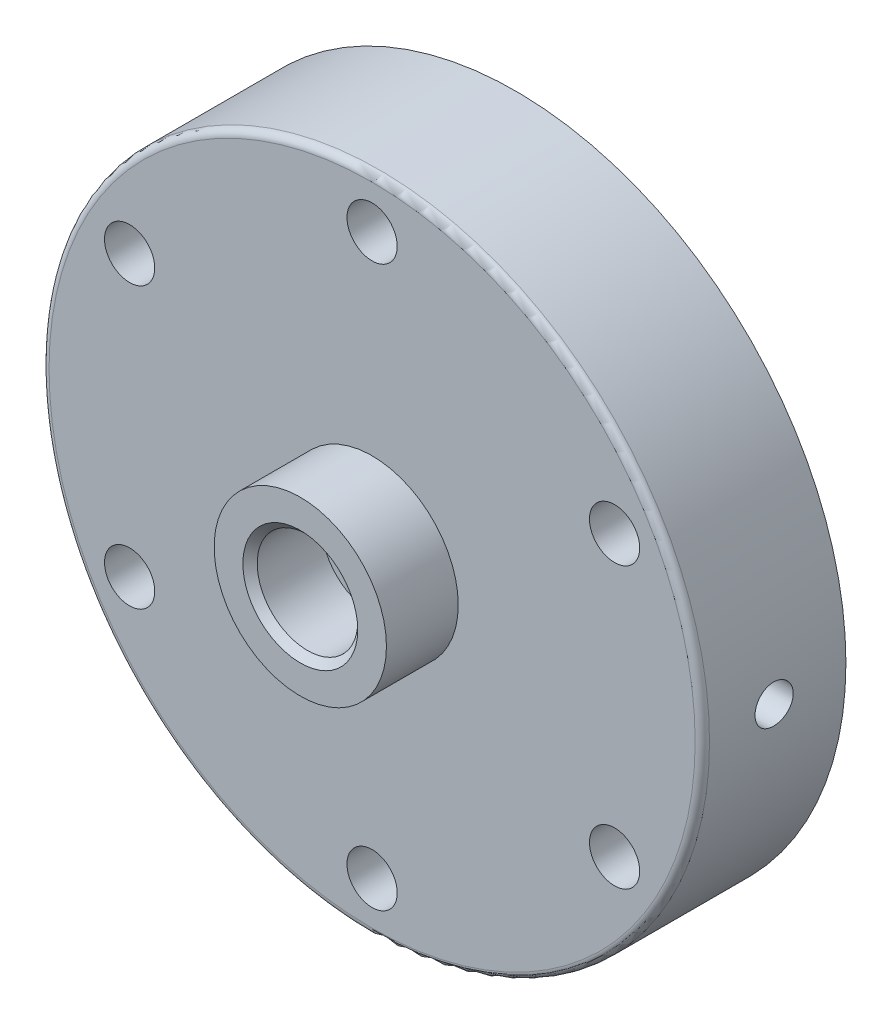
ISO-10303-21;
HEADER;
FILE_DESCRIPTION(('STEP AP214'),'2;1');
FILE_NAME('part.step','',(''),(''),'','','');
FILE_SCHEMA(('AUTOMOTIVE_DESIGN { 1 0 10303 214 1 1 1 1 }'));
ENDSEC;
DATA;
#1=APPLICATION_CONTEXT('core data for automotive mechanical design processes');
#2=APPLICATION_PROTOCOL_DEFINITION('international standard','automotive_design',2000,#1);
#3=PRODUCT_CONTEXT('',#1,'mechanical');
#4=PRODUCT('Part','Part','',(#3));
#5=PRODUCT_RELATED_PRODUCT_CATEGORY('part','',(#4));
#6=PRODUCT_DEFINITION_FORMATION('','',#4);
#7=PRODUCT_DEFINITION_CONTEXT('part definition',#1,'design');
#8=PRODUCT_DEFINITION('design','',#6,#7);
#9=PRODUCT_DEFINITION_SHAPE('','',#8);
#10=(LENGTH_UNIT() NAMED_UNIT(*) SI_UNIT(.MILLI.,.METRE.));
#11=(NAMED_UNIT(*) PLANE_ANGLE_UNIT() SI_UNIT($,.RADIAN.));
#12=(NAMED_UNIT(*) SI_UNIT($,.STERADIAN.) SOLID_ANGLE_UNIT());
#13=UNCERTAINTY_MEASURE_WITH_UNIT(LENGTH_MEASURE(1.E-05),#10,'distance_accuracy_value','');
#14=(GEOMETRIC_REPRESENTATION_CONTEXT(3) GLOBAL_UNCERTAINTY_ASSIGNED_CONTEXT((#13)) GLOBAL_UNIT_ASSIGNED_CONTEXT((#10,
#11,#12)) REPRESENTATION_CONTEXT('',''));
#15=CARTESIAN_POINT('',(0.,0.,0.));
#16=DIRECTION('',(0.,0.,1.));
#17=DIRECTION('',(1.,0.,0.));
#18=AXIS2_PLACEMENT_3D('',#15,#16,#17);
#19=CARTESIAN_POINT('',(0.,0.,20.));
#20=DIRECTION('',(0.,0.,-1.));
#21=DIRECTION('',(-1.,0.,0.));
#22=AXIS2_PLACEMENT_3D('',#19,#20,#21);
#23=CYLINDRICAL_SURFACE('',#22,2.5);
#24=CARTESIAN_POINT('',(0.,0.,20.));
#25=DIRECTION('',(0.,0.,1.));
#26=DIRECTION('',(1.,0.,0.));
#27=AXIS2_PLACEMENT_3D('',#24,#25,#26);
#28=CIRCLE('',#27,2.5);
#29=CARTESIAN_POINT('',(2.5,0.,20.));
#30=VERTEX_POINT('',#29);
#31=EDGE_CURVE('E208',#30,#30,#28,.T.);
#32=ORIENTED_EDGE('',*,*,#31,.T.);
#33=EDGE_LOOP('',(#32));
#34=FACE_BOUND('',#33,.T.);
#35=CARTESIAN_POINT('',(0.,0.,14.));
#36=DIRECTION('',(0.,0.,-1.));
#37=DIRECTION('',(-1.,0.,0.));
#38=AXIS2_PLACEMENT_3D('',#35,#36,#37);
#39=CIRCLE('',#38,2.5);
#40=CARTESIAN_POINT('',(-2.5,0.,14.));
#41=VERTEX_POINT('',#40);
#42=EDGE_CURVE('E234',#41,#41,#39,.T.);
#43=ORIENTED_EDGE('',*,*,#42,.T.);
#44=EDGE_LOOP('',(#43));
#45=FACE_BOUND('',#44,.T.);
#46=ADVANCED_FACE('F43',(#34,#45),#23,.F.);
#47=CARTESIAN_POINT('',(0.,0.,20.));
#48=DIRECTION('',(0.,0.,1.));
#49=DIRECTION('',(1.,0.,0.));
#50=AXIS2_PLACEMENT_3D('',#47,#48,#49);
#51=PLANE('',#50);
#52=ORIENTED_EDGE('',*,*,#31,.F.);
#53=EDGE_LOOP('',(#52));
#54=FACE_BOUND('',#53,.T.);
#55=CARTESIAN_POINT('',(0.,0.,20.));
#56=DIRECTION('',(0.,0.,1.));
#57=DIRECTION('',(1.,0.,0.));
#58=AXIS2_PLACEMENT_3D('',#55,#56,#57);
#59=CIRCLE('',#58,7.);
#60=CARTESIAN_POINT('',(7.,0.,20.));
#61=VERTEX_POINT('',#60);
#62=EDGE_CURVE('E224',#61,#61,#59,.F.);
#63=ORIENTED_EDGE('',*,*,#62,.F.);
#64=EDGE_LOOP('',(#63));
#65=FACE_BOUND('',#64,.T.);
#66=ADVANCED_FACE('F125',(#54,#65),#51,.T.);
#67=CARTESIAN_POINT('',(0.,0.,20.));
#68=DIRECTION('',(0.,0.,1.));
#69=DIRECTION('',(1.,0.,0.));
#70=AXIS2_PLACEMENT_3D('',#67,#68,#69);
#71=CIRCLE('',#70,45.);
#72=CARTESIAN_POINT('',(45.,0.,20.));
#73=VERTEX_POINT('',#72);
#74=EDGE_CURVE('E57',#73,#73,#71,.T.);
#75=ORIENTED_EDGE('',*,*,#74,.T.);
#76=EDGE_LOOP('',(#75));
#77=FACE_BOUND('',#76,.T.);
#78=CARTESIAN_POINT('',(0.,0.,20.));
#79=DIRECTION('',(0.,0.,1.));
#80=DIRECTION('',(1.,0.,0.));
#81=AXIS2_PLACEMENT_3D('',#78,#79,#80);
#82=CIRCLE('',#81,12.);
#83=CARTESIAN_POINT('',(12.,0.,20.));
#84=VERTEX_POINT('',#83);
#85=EDGE_CURVE('E152',#84,#84,#82,.T.);
#86=ORIENTED_EDGE('',*,*,#85,.F.);
#87=EDGE_LOOP('',(#86));
#88=FACE_BOUND('',#87,.T.);
#89=CARTESIAN_POINT('',(-33.7749907475898,-19.5000000000019,20.));
#90=DIRECTION('',(0.,0.,1.));
#91=DIRECTION('',(1.,0.,0.));
#92=AXIS2_PLACEMENT_3D('',#89,#90,#91);
#93=CIRCLE('',#92,3.50000000000408);
#94=CARTESIAN_POINT('',(-30.2749907475857,-19.5000000000019,20.));
#95=VERTEX_POINT('',#94);
#96=EDGE_CURVE('E156',#95,#95,#93,.T.);
#97=ORIENTED_EDGE('',*,*,#96,.F.);
#98=EDGE_LOOP('',(#97));
#99=FACE_BOUND('',#98,.T.);
#100=CARTESIAN_POINT('',(33.7749907475964,-19.4999999999981,20.));
#101=DIRECTION('',(0.,0.,1.));
#102=DIRECTION('',(1.,0.,0.));
#103=AXIS2_PLACEMENT_3D('',#100,#101,#102);
#104=CIRCLE('',#103,3.50000000000279);
#105=CARTESIAN_POINT('',(37.2749907475992,-19.4999999999981,20.));
#106=VERTEX_POINT('',#105);
#107=EDGE_CURVE('E160',#106,#106,#104,.T.);
#108=ORIENTED_EDGE('',*,*,#107,.F.);
#109=EDGE_LOOP('',(#108));
#110=FACE_BOUND('',#109,.T.);
#111=CARTESIAN_POINT('',(0.,39.,20.));
#112=DIRECTION('',(0.,0.,1.));
#113=DIRECTION('',(1.,0.,0.));
#114=AXIS2_PLACEMENT_3D('',#111,#112,#113);
#115=CIRCLE('',#114,3.5);
#116=CARTESIAN_POINT('',(3.5,39.,20.));
#117=VERTEX_POINT('',#116);
#118=EDGE_CURVE('E164',#117,#117,#115,.T.);
#119=ORIENTED_EDGE('',*,*,#118,.F.);
#120=EDGE_LOOP('',(#119));
#121=FACE_BOUND('',#120,.T.);
#122=CARTESIAN_POINT('',(33.7749907475942,19.5000000000019,20.));
#123=DIRECTION('',(0.,0.,1.));
#124=DIRECTION('',(1.,0.,0.));
#125=AXIS2_PLACEMENT_3D('',#122,#123,#124);
#126=CIRCLE('',#125,3.5000000000006);
#127=CARTESIAN_POINT('',(37.2749907475948,19.5000000000019,20.));
#128=VERTEX_POINT('',#127);
#129=EDGE_CURVE('E168',#128,#128,#126,.T.);
#130=ORIENTED_EDGE('',*,*,#129,.F.);
#131=EDGE_LOOP('',(#130));
#132=FACE_BOUND('',#131,.T.);
#133=CARTESIAN_POINT('',(4.419458303593E-12,-39.,20.));
#134=DIRECTION('',(0.,0.,1.));
#135=DIRECTION('',(1.,0.,0.));
#136=AXIS2_PLACEMENT_3D('',#133,#134,#135);
#137=CIRCLE('',#136,3.50000000000449);
#138=CARTESIAN_POINT('',(3.50000000000891,-39.,20.));
#139=VERTEX_POINT('',#138);
#140=EDGE_CURVE('E172',#139,#139,#137,.T.);
#141=ORIENTED_EDGE('',*,*,#140,.F.);
#142=EDGE_LOOP('',(#141));
#143=FACE_BOUND('',#142,.T.);
#144=CARTESIAN_POINT('',(-33.774990747592,19.4999999999981,20.));
#145=DIRECTION('',(0.,0.,1.));
#146=DIRECTION('',(1.,0.,0.));
#147=AXIS2_PLACEMENT_3D('',#144,#145,#146);
#148=CIRCLE('',#147,3.50000000000208);
#149=CARTESIAN_POINT('',(-30.2749907475899,19.4999999999981,20.));
#150=VERTEX_POINT('',#149);
#151=EDGE_CURVE('E175',#150,#150,#148,.T.);
#152=ORIENTED_EDGE('',*,*,#151,.F.);
#153=EDGE_LOOP('',(#152));
#154=FACE_BOUND('',#153,.T.);
#155=ADVANCED_FACE('F131',(#77,#88,#99,#110,#121,#132,#143,#154),#51,.T.);
#156=CARTESIAN_POINT('',(0.,0.,0.));
#157=DIRECTION('',(0.,0.,1.));
#158=DIRECTION('',(1.,0.,0.));
#159=AXIS2_PLACEMENT_3D('',#156,#157,#158);
#160=PLANE('',#159);
#161=CARTESIAN_POINT('',(0.,0.,0.));
#162=DIRECTION('',(0.,0.,-1.));
#163=DIRECTION('',(-1.,0.,0.));
#164=AXIS2_PLACEMENT_3D('',#161,#162,#163);
#165=CIRCLE('',#164,33.);
#166=CARTESIAN_POINT('',(-33.,0.,0.));
#167=VERTEX_POINT('',#166);
#168=EDGE_CURVE('E242',#167,#167,#165,.T.);
#169=ORIENTED_EDGE('',*,*,#168,.F.);
#170=EDGE_LOOP('',(#169));
#171=FACE_BOUND('',#170,.T.);
#172=CARTESIAN_POINT('',(0.,0.,0.));
#173=DIRECTION('',(0.,0.,1.));
#174=DIRECTION('',(1.,0.,0.));
#175=AXIS2_PLACEMENT_3D('',#172,#173,#174);
#176=CIRCLE('',#175,46.);
#177=CARTESIAN_POINT('',(46.,0.,0.));
#178=VERTEX_POINT('',#177);
#179=EDGE_CURVE('E217',#178,#178,#176,.T.);
#180=ORIENTED_EDGE('',*,*,#179,.F.);
#181=EDGE_LOOP('',(#180));
#182=FACE_BOUND('',#181,.T.);
#183=CARTESIAN_POINT('',(0.,39.,0.));
#184=DIRECTION('',(0.,0.,1.));
#185=DIRECTION('',(1.,0.,0.));
#186=AXIS2_PLACEMENT_3D('',#183,#184,#185);
#187=CIRCLE('',#186,3.5);
#188=CARTESIAN_POINT('',(3.5,39.,0.));
#189=VERTEX_POINT('',#188);
#190=EDGE_CURVE('E214',#189,#189,#187,.T.);
#191=ORIENTED_EDGE('',*,*,#190,.T.);
#192=EDGE_LOOP('',(#191));
#193=FACE_BOUND('',#192,.T.);
#194=CARTESIAN_POINT('',(33.7749907475942,19.5000000000019,0.));
#195=DIRECTION('',(0.,0.,1.));
#196=DIRECTION('',(1.,0.,0.));
#197=AXIS2_PLACEMENT_3D('',#194,#195,#196);
#198=CIRCLE('',#197,3.5000000000006);
#199=CARTESIAN_POINT('',(37.2749907475948,19.5000000000019,0.));
#200=VERTEX_POINT('',#199);
#201=EDGE_CURVE('E202',#200,#200,#198,.T.);
#202=ORIENTED_EDGE('',*,*,#201,.T.);
#203=EDGE_LOOP('',(#202));
#204=FACE_BOUND('',#203,.T.);
#205=CARTESIAN_POINT('',(33.7749907475964,-19.4999999999981,0.));
#206=DIRECTION('',(0.,0.,1.));
#207=DIRECTION('',(1.,0.,0.));
#208=AXIS2_PLACEMENT_3D('',#205,#206,#207);
#209=CIRCLE('',#208,3.50000000000279);
#210=CARTESIAN_POINT('',(37.2749907475992,-19.4999999999981,0.));
#211=VERTEX_POINT('',#210);
#212=EDGE_CURVE('E196',#211,#211,#209,.T.);
#213=ORIENTED_EDGE('',*,*,#212,.T.);
#214=EDGE_LOOP('',(#213));
#215=FACE_BOUND('',#214,.T.);
#216=CARTESIAN_POINT('',(4.419458303593E-12,-39.,0.));
#217=DIRECTION('',(0.,0.,1.));
#218=DIRECTION('',(1.,0.,0.));
#219=AXIS2_PLACEMENT_3D('',#216,#217,#218);
#220=CIRCLE('',#219,3.50000000000449);
#221=CARTESIAN_POINT('',(3.50000000000891,-39.,0.));
#222=VERTEX_POINT('',#221);
#223=EDGE_CURVE('E192',#222,#222,#220,.T.);
#224=ORIENTED_EDGE('',*,*,#223,.T.);
#225=EDGE_LOOP('',(#224));
#226=FACE_BOUND('',#225,.T.);
#227=CARTESIAN_POINT('',(-33.7749907475898,-19.5000000000019,0.));
#228=DIRECTION('',(0.,0.,1.));
#229=DIRECTION('',(1.,0.,0.));
#230=AXIS2_PLACEMENT_3D('',#227,#228,#229);
#231=CIRCLE('',#230,3.50000000000408);
#232=CARTESIAN_POINT('',(-30.2749907475857,-19.5000000000019,0.));
#233=VERTEX_POINT('',#232);
#234=EDGE_CURVE('E178',#233,#233,#231,.T.);
#235=ORIENTED_EDGE('',*,*,#234,.T.);
#236=EDGE_LOOP('',(#235));
#237=FACE_BOUND('',#236,.T.);
#238=CARTESIAN_POINT('',(-33.774990747592,19.4999999999981,0.));
#239=DIRECTION('',(0.,0.,1.));
#240=DIRECTION('',(1.,0.,0.));
#241=AXIS2_PLACEMENT_3D('',#238,#239,#240);
#242=CIRCLE('',#241,3.50000000000208);
#243=CARTESIAN_POINT('',(-30.2749907475899,19.4999999999981,0.));
#244=VERTEX_POINT('',#243);
#245=EDGE_CURVE('E179',#244,#244,#242,.T.);
#246=ORIENTED_EDGE('',*,*,#245,.T.);
#247=EDGE_LOOP('',(#246));
#248=FACE_BOUND('',#247,.T.);
#249=ADVANCED_FACE('F104',(#171,#182,#193,#204,#215,#226,#237,#248),#160,.F.);
#250=CARTESIAN_POINT('',(0.,0.,20.));
#251=DIRECTION('',(0.,0.,-1.));
#252=DIRECTION('',(-1.,0.,0.));
#253=AXIS2_PLACEMENT_3D('',#250,#251,#252);
#254=CYLINDRICAL_SURFACE('',#253,46.);
#255=CARTESIAN_POINT('',(-46.,0.,7.33976097996437));
#256=CARTESIAN_POINT('',(-45.999998974776,0.149292917161702,7.33976755696187));
#257=CARTESIAN_POINT('',(-45.9992654279732,0.298690903799143,7.35237070533642));
#258=CARTESIAN_POINT('',(-45.9964096857222,0.593363200255416,7.40246712973012));
#259=CARTESIAN_POINT('',(-45.9942858661076,0.73863247940457,7.43998951804291));
#260=CARTESIAN_POINT('',(-45.9888898870718,1.02073626022256,7.53884445911305));
#261=CARTESIAN_POINT('',(-45.9856183253,1.15757510825203,7.60016462171377));
#262=CARTESIAN_POINT('',(-45.9782950198087,1.41898116754632,7.74485478413762));
#263=CARTESIAN_POINT('',(-45.9742434570167,1.54355121455091,7.82821967217774));
#264=CARTESIAN_POINT('',(-45.9658098046685,1.77708220584144,8.01475250873708));
#265=CARTESIAN_POINT('',(-45.9614273416313,1.88602509759197,8.1179430431944));
#266=CARTESIAN_POINT('',(-45.9528290183082,2.08505508646386,8.34115188228659));
#267=CARTESIAN_POINT('',(-45.9486131649268,2.17514140280068,8.46117088338567));
#268=CARTESIAN_POINT('',(-45.9408206759462,2.33395478604573,8.71472958853048));
#269=CARTESIAN_POINT('',(-45.937244481294,2.40266714280453,8.84827852081625));
#270=CARTESIAN_POINT('',(-45.9311393395253,2.51668791417905,9.12504133712409));
#271=CARTESIAN_POINT('',(-45.9286103824732,2.56199655083487,9.26825512943734));
#272=CARTESIAN_POINT('',(-45.9248884051809,2.6278743956767,9.56011089953697));
#273=CARTESIAN_POINT('',(-45.9236938794532,2.64847148504125,9.70874656446108));
#274=CARTESIAN_POINT('',(-45.9227709584627,2.66442761199094,10.0073700798411));
#275=CARTESIAN_POINT('',(-45.9230425486075,2.65978690076881,10.157357916824));
#276=CARTESIAN_POINT('',(-45.9250198340107,2.62542232642799,10.4542383806184));
#277=CARTESIAN_POINT('',(-45.9267238053775,2.59572861479908,10.6011345106068));
#278=CARTESIAN_POINT('',(-45.9313711004387,2.51214768615222,10.8878538268438));
#279=CARTESIAN_POINT('',(-45.9343144306863,2.4582603412079,11.0276769756889));
#280=CARTESIAN_POINT('',(-45.9411107169374,2.32778749799265,11.2963782439919));
#281=CARTESIAN_POINT('',(-45.9449642218848,2.25118829461282,11.4252496942358));
#282=CARTESIAN_POINT('',(-45.953146014227,2.07747605508616,11.6683164554585));
#283=CARTESIAN_POINT('',(-45.9574743061661,1.98036282259206,11.7825116259486));
#284=CARTESIAN_POINT('',(-45.9661255323183,1.76820926276036,11.9931596975409));
#285=CARTESIAN_POINT('',(-45.9704484493462,1.65314283500512,12.0895863143542));
#286=CARTESIAN_POINT('',(-45.9785956225304,1.40844078771433,12.2617574201692));
#287=CARTESIAN_POINT('',(-45.9824198785349,1.27880516373917,12.3375019028685));
#288=CARTESIAN_POINT('',(-45.9891390158704,1.00862888584404,12.466156291019));
#289=CARTESIAN_POINT('',(-45.9920338579549,0.868087771726305,12.5190652322207));
#290=CARTESIAN_POINT('',(-45.9965673977885,0.580096959150581,12.600529240015));
#291=CARTESIAN_POINT('',(-45.998206108103,0.432647329816102,12.6290845502243));
#292=CARTESIAN_POINT('',(-46.0000410986464,0.135253143101079,12.6609982160517));
#293=CARTESIAN_POINT('',(-46.0002394595771,-0.0146875016119143,12.6643929183607));
#294=CARTESIAN_POINT('',(-45.9991769280793,-0.313007983129885,12.645983927416));
#295=CARTESIAN_POINT('',(-45.9979160421376,-0.461387826870186,12.624180346177));
#296=CARTESIAN_POINT('',(-45.9940783292441,-0.752272573885855,12.5560238019498));
#297=CARTESIAN_POINT('',(-45.9915023945139,-0.894781389725635,12.5096874829064));
#298=CARTESIAN_POINT('',(-45.9853244701923,-1.16999944735018,12.393797672545));
#299=CARTESIAN_POINT('',(-45.9817224726933,-1.30270861359996,12.3242440022921));
#300=CARTESIAN_POINT('',(-45.9738921603038,-1.55472687015403,12.1638011245134));
#301=CARTESIAN_POINT('',(-45.9696631337944,-1.67402046094942,12.072887606124));
#302=CARTESIAN_POINT('',(-45.961057213383,-1.89566530448109,11.8723411719025));
#303=CARTESIAN_POINT('',(-45.9566803182285,-1.99801641367993,11.7627080974935));
#304=CARTESIAN_POINT('',(-45.948265980264,-2.18299374482706,11.5276779983847));
#305=CARTESIAN_POINT('',(-45.9442289464979,-2.26559641213999,11.4022624186868));
#306=CARTESIAN_POINT('',(-45.9369560640936,-2.40857100839959,11.1393208476357));
#307=CARTESIAN_POINT('',(-45.9337202110927,-2.46894305839748,11.0017949222313));
#308=CARTESIAN_POINT('',(-45.9284175354658,-2.56570177637644,10.718623041942));
#309=CARTESIAN_POINT('',(-45.9263499866745,-2.60210334565954,10.5729821929164));
#310=CARTESIAN_POINT('',(-45.9236150519889,-2.64993648977181,10.2776435426043));
#311=CARTESIAN_POINT('',(-45.922947654579,-2.66136826996758,10.1279457746946));
#312=CARTESIAN_POINT('',(-45.9230885638232,-2.65893538400768,9.82897695127391));
#313=CARTESIAN_POINT('',(-45.9238947097273,-2.64510775734,9.67970559191665));
#314=CARTESIAN_POINT('',(-45.9268872830539,-2.59262527758871,9.38560770672435));
#315=CARTESIAN_POINT('',(-45.9290737130331,-2.55397037851572,9.24078118912333));
#316=CARTESIAN_POINT('',(-45.9345799350479,-2.45293869050492,8.9596777167533));
#317=CARTESIAN_POINT('',(-45.9378997263199,-2.39056191755001,8.82340075622399));
#318=CARTESIAN_POINT('',(-45.9452984612825,-2.24386262665865,8.56324972277166));
#319=CARTESIAN_POINT('',(-45.9493773838618,-2.1595407189884,8.43937530508237));
#320=CARTESIAN_POINT('',(-45.9578416256022,-1.97120907917885,8.20735871628615));
#321=CARTESIAN_POINT('',(-45.9622273519265,-1.86717285880331,8.09923806177829));
#322=CARTESIAN_POINT('',(-45.9708076609383,-1.64239596236604,7.90196045977996));
#323=CARTESIAN_POINT('',(-45.9750021964943,-1.52165119667649,7.8128081686342));
#324=CARTESIAN_POINT('',(-45.9827312385139,-1.26676439145265,7.65594198914745));
#325=CARTESIAN_POINT('',(-45.9862649971405,-1.13260743289091,7.58825233169785));
#326=CARTESIAN_POINT('',(-45.9922638585437,-0.854911054201924,7.47644049182185));
#327=CARTESIAN_POINT('',(-45.9947302165188,-0.711382883991956,7.43229061378601));
#328=CARTESIAN_POINT('',(-45.9976676434613,-0.472475934052935,7.3803287521296));
#329=CARTESIAN_POINT('',(-45.9985384074075,-0.378642724126605,7.36513540929109));
#330=CARTESIAN_POINT('',(-45.9997049114126,-0.189887179689612,7.34484943729514));
#331=CARTESIAN_POINT('',(-46.0000006521424,-0.0949648464497885,7.33975679635293));
#332=CARTESIAN_POINT('',(-46.,0.,7.33976097996437));
#333=B_SPLINE_CURVE_WITH_KNOTS('',3,(#255,#256,#257,#258,#259,#260,#261,#262,#263,#264,#265,
#266,#267,#268,#269,#270,#271,#272,#273,#274,#275,#276,#277,#278,#279,#280,#281,#282,#283,#284,
#285,#286,#287,#288,#289,#290,#291,#292,#293,#294,#295,#296,#297,#298,#299,#300,#301,#302,#303,
#304,#305,#306,#307,#308,#309,#310,#311,#312,#313,#314,#315,#316,#317,#318,#319,#320,#321,#322,
#323,#324,#325,#326,#327,#328,#329,#330,#331,#332),.UNSPECIFIED.,.T.,.F.,(4,2,2,2,2,2,2,2,2,2,2,
2,2,2,2,2,2,2,2,2,2,2,2,2,2,2,2,2,2,2,2,2,2,2,2,2,2,2,4),(0.,0.447532081836894,
0.895587921964389,1.34341079700723,1.79112992074391,2.23936215605596,2.68761294742005,
3.13617155827838,3.58472591341044,4.03277370291118,4.48081703298461,4.92832190717054,
5.37582914761327,5.82360698066006,6.27138909974625,6.71982837830062,7.1682677935067,
7.61672614258592,8.06518000554947,8.51298591132593,8.96078982646298,9.40829032291553,
9.85579426830944,10.3038100321905,10.7518295914867,11.2003808823447,11.6489297306938,
12.0971994737648,12.545465529981,12.9930747925091,13.4406848841791,13.8882946742669,
14.3358920182274,14.7840950757152,15.2324080312544,15.6812253358617,16.129513414925,
16.4141877707269,16.6988617943912),.UNSPECIFIED.);
#334=CARTESIAN_POINT('',(-46.,0.,7.33976097996437));
#335=VERTEX_POINT('',#334);
#336=EDGE_CURVE('E94',#335,#335,#333,.T.);
#337=ORIENTED_EDGE('',*,*,#336,.T.);
#338=EDGE_LOOP('',(#337));
#339=FACE_BOUND('',#338,.T.);
#340=CARTESIAN_POINT('',(46.,0.,7.33976097996437));
#341=CARTESIAN_POINT('',(45.999998974776,-0.149292917161702,7.33976755696187));
#342=CARTESIAN_POINT('',(45.9992654279732,-0.298690903799143,7.35237070533642));
#343=CARTESIAN_POINT('',(45.9964096857222,-0.593363200255416,7.40246712973012));
#344=CARTESIAN_POINT('',(45.9942858661076,-0.73863247940457,7.43998951804291));
#345=CARTESIAN_POINT('',(45.9888898870718,-1.02073626022256,7.53884445911305));
#346=CARTESIAN_POINT('',(45.9856183253,-1.15757510825203,7.60016462171377));
#347=CARTESIAN_POINT('',(45.9782950198087,-1.41898116754632,7.74485478413762));
#348=CARTESIAN_POINT('',(45.9742434570167,-1.54355121455091,7.82821967217774));
#349=CARTESIAN_POINT('',(45.9658098046685,-1.77708220584144,8.01475250873708));
#350=CARTESIAN_POINT('',(45.9614273416313,-1.88602509759197,8.1179430431944));
#351=CARTESIAN_POINT('',(45.9528290183082,-2.08505508646386,8.34115188228659));
#352=CARTESIAN_POINT('',(45.9486131649268,-2.17514140280068,8.46117088338567));
#353=CARTESIAN_POINT('',(45.9408206759462,-2.33395478604573,8.71472958853048));
#354=CARTESIAN_POINT('',(45.937244481294,-2.40266714280453,8.84827852081625));
#355=CARTESIAN_POINT('',(45.9311393395253,-2.51668791417905,9.12504133712409));
#356=CARTESIAN_POINT('',(45.9286103824732,-2.56199655083487,9.26825512943734));
#357=CARTESIAN_POINT('',(45.9248884051809,-2.6278743956767,9.56011089953697));
#358=CARTESIAN_POINT('',(45.9236938794532,-2.64847148504125,9.70874656446108));
#359=CARTESIAN_POINT('',(45.9227709584627,-2.66442761199094,10.0073700798411));
#360=CARTESIAN_POINT('',(45.9230425486075,-2.65978690076881,10.157357916824));
#361=CARTESIAN_POINT('',(45.9250198340107,-2.62542232642799,10.4542383806184));
#362=CARTESIAN_POINT('',(45.9267238053775,-2.59572861479908,10.6011345106068));
#363=CARTESIAN_POINT('',(45.9313711004387,-2.51214768615222,10.8878538268438));
#364=CARTESIAN_POINT('',(45.9343144306863,-2.4582603412079,11.0276769756889));
#365=CARTESIAN_POINT('',(45.9411107169374,-2.32778749799265,11.2963782439919));
#366=CARTESIAN_POINT('',(45.9449642218848,-2.25118829461282,11.4252496942358));
#367=CARTESIAN_POINT('',(45.953146014227,-2.07747605508616,11.6683164554585));
#368=CARTESIAN_POINT('',(45.9574743061661,-1.98036282259206,11.7825116259486));
#369=CARTESIAN_POINT('',(45.9661255323183,-1.76820926276036,11.9931596975409));
#370=CARTESIAN_POINT('',(45.9704484493462,-1.65314283500512,12.0895863143542));
#371=CARTESIAN_POINT('',(45.9785956225304,-1.40844078771433,12.2617574201692));
#372=CARTESIAN_POINT('',(45.9824198785349,-1.27880516373917,12.3375019028685));
#373=CARTESIAN_POINT('',(45.9891390158704,-1.00862888584404,12.466156291019));
#374=CARTESIAN_POINT('',(45.9920338579549,-0.868087771726305,12.5190652322207));
#375=CARTESIAN_POINT('',(45.9965673977885,-0.580096959150581,12.600529240015));
#376=CARTESIAN_POINT('',(45.998206108103,-0.432647329816102,12.6290845502243));
#377=CARTESIAN_POINT('',(46.0000410986464,-0.135253143101079,12.6609982160517));
#378=CARTESIAN_POINT('',(46.0002394595771,0.0146875016119143,12.6643929183607));
#379=CARTESIAN_POINT('',(45.9991769280793,0.313007983129885,12.645983927416));
#380=CARTESIAN_POINT('',(45.9979160421376,0.461387826870186,12.624180346177));
#381=CARTESIAN_POINT('',(45.9940783292441,0.752272573885855,12.5560238019498));
#382=CARTESIAN_POINT('',(45.9915023945139,0.894781389725635,12.5096874829064));
#383=CARTESIAN_POINT('',(45.9853244701923,1.16999944735018,12.393797672545));
#384=CARTESIAN_POINT('',(45.9817224726933,1.30270861359996,12.3242440022921));
#385=CARTESIAN_POINT('',(45.9738921603038,1.55472687015403,12.1638011245134));
#386=CARTESIAN_POINT('',(45.9696631337944,1.67402046094942,12.072887606124));
#387=CARTESIAN_POINT('',(45.961057213383,1.89566530448109,11.8723411719025));
#388=CARTESIAN_POINT('',(45.9566803182285,1.99801641367993,11.7627080974935));
#389=CARTESIAN_POINT('',(45.948265980264,2.18299374482706,11.5276779983847));
#390=CARTESIAN_POINT('',(45.9442289464979,2.26559641213999,11.4022624186868));
#391=CARTESIAN_POINT('',(45.9369560640936,2.40857100839959,11.1393208476357));
#392=CARTESIAN_POINT('',(45.9337202110927,2.46894305839748,11.0017949222313));
#393=CARTESIAN_POINT('',(45.9284175354658,2.56570177637644,10.718623041942));
#394=CARTESIAN_POINT('',(45.9263499866745,2.60210334565954,10.5729821929164));
#395=CARTESIAN_POINT('',(45.9236150519889,2.64993648977181,10.2776435426043));
#396=CARTESIAN_POINT('',(45.922947654579,2.66136826996758,10.1279457746946));
#397=CARTESIAN_POINT('',(45.9230885638232,2.65893538400768,9.82897695127391));
#398=CARTESIAN_POINT('',(45.9238947097273,2.64510775734,9.67970559191665));
#399=CARTESIAN_POINT('',(45.9268872830539,2.59262527758871,9.38560770672435));
#400=CARTESIAN_POINT('',(45.9290737130331,2.55397037851572,9.24078118912333));
#401=CARTESIAN_POINT('',(45.9345799350479,2.45293869050492,8.9596777167533));
#402=CARTESIAN_POINT('',(45.9378997263199,2.39056191755001,8.82340075622399));
#403=CARTESIAN_POINT('',(45.9452984612825,2.24386262665865,8.56324972277166));
#404=CARTESIAN_POINT('',(45.9493773838618,2.1595407189884,8.43937530508237));
#405=CARTESIAN_POINT('',(45.9578416256022,1.97120907917885,8.20735871628615));
#406=CARTESIAN_POINT('',(45.9622273519265,1.86717285880331,8.09923806177829));
#407=CARTESIAN_POINT('',(45.9708076609383,1.64239596236604,7.90196045977996));
#408=CARTESIAN_POINT('',(45.9750021964943,1.52165119667649,7.8128081686342));
#409=CARTESIAN_POINT('',(45.9827312385139,1.26676439145265,7.65594198914745));
#410=CARTESIAN_POINT('',(45.9862649971405,1.13260743289091,7.58825233169785));
#411=CARTESIAN_POINT('',(45.9922638585437,0.854911054201924,7.47644049182185));
#412=CARTESIAN_POINT('',(45.9947302165188,0.711382883991956,7.43229061378601));
#413=CARTESIAN_POINT('',(45.9976676434613,0.472475934052935,7.3803287521296));
#414=CARTESIAN_POINT('',(45.9985384074075,0.378642724126605,7.36513540929109));
#415=CARTESIAN_POINT('',(45.9997049114126,0.189887179689612,7.34484943729514));
#416=CARTESIAN_POINT('',(46.0000006521424,0.0949648464497885,7.33975679635293));
#417=CARTESIAN_POINT('',(46.,0.,7.33976097996437));
#418=B_SPLINE_CURVE_WITH_KNOTS('',3,(#340,#341,#342,#343,#344,#345,#346,#347,#348,#349,#350,
#351,#352,#353,#354,#355,#356,#357,#358,#359,#360,#361,#362,#363,#364,#365,#366,#367,#368,#369,
#370,#371,#372,#373,#374,#375,#376,#377,#378,#379,#380,#381,#382,#383,#384,#385,#386,#387,#388,
#389,#390,#391,#392,#393,#394,#395,#396,#397,#398,#399,#400,#401,#402,#403,#404,#405,#406,#407,
#408,#409,#410,#411,#412,#413,#414,#415,#416,#417),.UNSPECIFIED.,.T.,.F.,(4,2,2,2,2,2,2,2,2,2,2,
2,2,2,2,2,2,2,2,2,2,2,2,2,2,2,2,2,2,2,2,2,2,2,2,2,2,2,4),(0.,0.447532081836894,
0.895587921964389,1.34341079700723,1.79112992074391,2.23936215605596,2.68761294742005,
3.13617155827838,3.58472591341044,4.03277370291118,4.48081703298461,4.92832190717054,
5.37582914761327,5.82360698066006,6.27138909974625,6.71982837830062,7.1682677935067,
7.61672614258592,8.06518000554947,8.51298591132593,8.96078982646298,9.40829032291553,
9.85579426830944,10.3038100321905,10.7518295914867,11.2003808823447,11.6489297306938,
12.0971994737648,12.545465529981,12.9930747925091,13.4406848841791,13.8882946742669,
14.3358920182274,14.7840950757152,15.2324080312544,15.6812253358617,16.129513414925,
16.4141877707269,16.6988617943912),.UNSPECIFIED.);
#419=CARTESIAN_POINT('',(46.,0.,7.33976097996437));
#420=VERTEX_POINT('',#419);
#421=EDGE_CURVE('E87',#420,#420,#418,.T.);
#422=ORIENTED_EDGE('',*,*,#421,.T.);
#423=EDGE_LOOP('',(#422));
#424=FACE_BOUND('',#423,.T.);
#425=CARTESIAN_POINT('',(0.,0.,19.));
#426=DIRECTION('',(0.,0.,1.));
#427=DIRECTION('',(1.,0.,0.));
#428=AXIS2_PLACEMENT_3D('',#425,#426,#427);
#429=CIRCLE('',#428,46.);
#430=CARTESIAN_POINT('',(46.,0.,19.));
#431=VERTEX_POINT('',#430);
#432=EDGE_CURVE('E10',#431,#431,#429,.F.);
#433=ORIENTED_EDGE('',*,*,#432,.T.);
#434=EDGE_LOOP('',(#433));
#435=FACE_BOUND('',#434,.T.);
#436=ORIENTED_EDGE('',*,*,#179,.T.);
#437=EDGE_LOOP('',(#436));
#438=FACE_BOUND('',#437,.T.);
#439=ADVANCED_FACE('F99',(#339,#424,#435,#438),#254,.T.);
#440=CARTESIAN_POINT('',(0.,39.,20.));
#441=DIRECTION('',(0.,0.,-1.));
#442=DIRECTION('',(-1.,0.,0.));
#443=AXIS2_PLACEMENT_3D('',#440,#441,#442);
#444=CYLINDRICAL_SURFACE('',#443,3.5);
#445=ORIENTED_EDGE('',*,*,#118,.T.);
#446=EDGE_LOOP('',(#445));
#447=FACE_BOUND('',#446,.T.);
#448=ORIENTED_EDGE('',*,*,#190,.F.);
#449=EDGE_LOOP('',(#448));
#450=FACE_BOUND('',#449,.T.);
#451=ADVANCED_FACE('F103',(#447,#450),#444,.F.);
#452=CARTESIAN_POINT('',(33.7749907475942,19.5000000000019,20.));
#453=DIRECTION('',(0.,0.,-1.));
#454=DIRECTION('',(-1.,0.,0.));
#455=AXIS2_PLACEMENT_3D('',#452,#453,#454);
#456=CYLINDRICAL_SURFACE('',#455,3.5000000000006);
#457=ORIENTED_EDGE('',*,*,#129,.T.);
#458=EDGE_LOOP('',(#457));
#459=FACE_BOUND('',#458,.T.);
#460=ORIENTED_EDGE('',*,*,#201,.F.);
#461=EDGE_LOOP('',(#460));
#462=FACE_BOUND('',#461,.T.);
#463=ADVANCED_FACE('F137',(#459,#462),#456,.F.);
#464=CARTESIAN_POINT('',(33.7749907475964,-19.4999999999981,20.));
#465=DIRECTION('',(0.,0.,-1.));
#466=DIRECTION('',(-1.,0.,0.));
#467=AXIS2_PLACEMENT_3D('',#464,#465,#466);
#468=CYLINDRICAL_SURFACE('',#467,3.50000000000279);
#469=ORIENTED_EDGE('',*,*,#107,.T.);
#470=EDGE_LOOP('',(#469));
#471=FACE_BOUND('',#470,.T.);
#472=ORIENTED_EDGE('',*,*,#212,.F.);
#473=EDGE_LOOP('',(#472));
#474=FACE_BOUND('',#473,.T.);
#475=ADVANCED_FACE('F272',(#471,#474),#468,.F.);
#476=CARTESIAN_POINT('',(4.419458303593E-12,-39.,20.));
#477=DIRECTION('',(0.,0.,-1.));
#478=DIRECTION('',(-1.,0.,0.));
#479=AXIS2_PLACEMENT_3D('',#476,#477,#478);
#480=CYLINDRICAL_SURFACE('',#479,3.50000000000449);
#481=ORIENTED_EDGE('',*,*,#140,.T.);
#482=EDGE_LOOP('',(#481));
#483=FACE_BOUND('',#482,.T.);
#484=ORIENTED_EDGE('',*,*,#223,.F.);
#485=EDGE_LOOP('',(#484));
#486=FACE_BOUND('',#485,.T.);
#487=ADVANCED_FACE('F269',(#483,#486),#480,.F.);
#488=CARTESIAN_POINT('',(-33.7749907475898,-19.5000000000019,20.));
#489=DIRECTION('',(0.,0.,-1.));
#490=DIRECTION('',(-1.,0.,0.));
#491=AXIS2_PLACEMENT_3D('',#488,#489,#490);
#492=CYLINDRICAL_SURFACE('',#491,3.50000000000408);
#493=ORIENTED_EDGE('',*,*,#96,.T.);
#494=EDGE_LOOP('',(#493));
#495=FACE_BOUND('',#494,.T.);
#496=ORIENTED_EDGE('',*,*,#234,.F.);
#497=EDGE_LOOP('',(#496));
#498=FACE_BOUND('',#497,.T.);
#499=ADVANCED_FACE('F266',(#495,#498),#492,.F.);
#500=CARTESIAN_POINT('',(-33.774990747592,19.4999999999981,20.));
#501=DIRECTION('',(0.,0.,-1.));
#502=DIRECTION('',(-1.,0.,0.));
#503=AXIS2_PLACEMENT_3D('',#500,#501,#502);
#504=CYLINDRICAL_SURFACE('',#503,3.50000000000208);
#505=ORIENTED_EDGE('',*,*,#151,.T.);
#506=EDGE_LOOP('',(#505));
#507=FACE_BOUND('',#506,.T.);
#508=ORIENTED_EDGE('',*,*,#245,.F.);
#509=EDGE_LOOP('',(#508));
#510=FACE_BOUND('',#509,.T.);
#511=ADVANCED_FACE('F260',(#507,#510),#504,.F.);
#512=CARTESIAN_POINT('',(0.,0.,30.));
#513=DIRECTION('',(0.,0.,1.));
#514=DIRECTION('',(1.,0.,0.));
#515=AXIS2_PLACEMENT_3D('',#512,#513,#514);
#516=PLANE('',#515);
#517=CARTESIAN_POINT('',(0.,0.,30.));
#518=DIRECTION('',(0.,0.,1.));
#519=DIRECTION('',(1.,0.,0.));
#520=AXIS2_PLACEMENT_3D('',#517,#518,#519);
#521=CIRCLE('',#520,7.99999999999999);
#522=CARTESIAN_POINT('',(7.99999999999999,0.,30.));
#523=VERTEX_POINT('',#522);
#524=EDGE_CURVE('E63',#523,#523,#521,.F.);
#525=ORIENTED_EDGE('',*,*,#524,.T.);
#526=EDGE_LOOP('',(#525));
#527=FACE_BOUND('',#526,.T.);
#528=CARTESIAN_POINT('',(0.,0.,30.));
#529=DIRECTION('',(0.,0.,1.));
#530=DIRECTION('',(1.,0.,0.));
#531=AXIS2_PLACEMENT_3D('',#528,#529,#530);
#532=CIRCLE('',#531,12.);
#533=CARTESIAN_POINT('',(12.,0.,30.));
#534=VERTEX_POINT('',#533);
#535=EDGE_CURVE('E186',#534,#534,#532,.T.);
#536=ORIENTED_EDGE('',*,*,#535,.T.);
#537=EDGE_LOOP('',(#536));
#538=FACE_BOUND('',#537,.T.);
#539=ADVANCED_FACE('F252',(#527,#538),#516,.T.);
#540=CARTESIAN_POINT('',(0.,0.,30.));
#541=DIRECTION('',(0.,0.,-1.));
#542=DIRECTION('',(-1.,0.,0.));
#543=AXIS2_PLACEMENT_3D('',#540,#541,#542);
#544=CYLINDRICAL_SURFACE('',#543,12.);
#545=ORIENTED_EDGE('',*,*,#535,.F.);
#546=EDGE_LOOP('',(#545));
#547=FACE_BOUND('',#546,.T.);
#548=ORIENTED_EDGE('',*,*,#85,.T.);
#549=EDGE_LOOP('',(#548));
#550=FACE_BOUND('',#549,.T.);
#551=ADVANCED_FACE('F120',(#547,#550),#544,.T.);
#552=CARTESIAN_POINT('',(0.,0.,30.));
#553=DIRECTION('',(0.,0.,-1.));
#554=DIRECTION('',(-1.,0.,0.));
#555=AXIS2_PLACEMENT_3D('',#552,#553,#554);
#556=CYLINDRICAL_SURFACE('',#555,7.);
#557=CARTESIAN_POINT('',(0.,0.,29.));
#558=DIRECTION('',(0.,0.,1.));
#559=DIRECTION('',(1.,0.,0.));
#560=AXIS2_PLACEMENT_3D('',#557,#558,#559);
#561=CIRCLE('',#560,7.);
#562=CARTESIAN_POINT('',(7.,0.,29.));
#563=VERTEX_POINT('',#562);
#564=EDGE_CURVE('E228',#563,#563,#561,.T.);
#565=ORIENTED_EDGE('',*,*,#564,.T.);
#566=EDGE_LOOP('',(#565));
#567=FACE_BOUND('',#566,.T.);
#568=ORIENTED_EDGE('',*,*,#62,.T.);
#569=EDGE_LOOP('',(#568));
#570=FACE_BOUND('',#569,.T.);
#571=ADVANCED_FACE('F113',(#567,#570),#556,.F.);
#572=CARTESIAN_POINT('',(0.,0.,29.));
#573=DIRECTION('',(0.,0.,1.));
#574=DIRECTION('',(1.,0.,0.));
#575=AXIS2_PLACEMENT_3D('',#572,#573,#574);
#576=CONICAL_SURFACE('',#575,7.,0.785398163397443);
#577=ORIENTED_EDGE('',*,*,#524,.F.);
#578=EDGE_LOOP('',(#577));
#579=FACE_BOUND('',#578,.T.);
#580=ORIENTED_EDGE('',*,*,#564,.F.);
#581=EDGE_LOOP('',(#580));
#582=FACE_BOUND('',#581,.T.);
#583=ADVANCED_FACE('F108',(#579,#582),#576,.F.);
#584=CARTESIAN_POINT('',(0.,0.,14.));
#585=DIRECTION('',(0.,0.,-1.));
#586=DIRECTION('',(-1.,0.,0.));
#587=AXIS2_PLACEMENT_3D('',#584,#585,#586);
#588=CYLINDRICAL_SURFACE('',#587,33.);
#589=CARTESIAN_POINT('',(-33.,0.,12.6602390200356));
#590=CARTESIAN_POINT('',(-32.9999985921079,0.149166980979102,12.6602324972829));
#591=CARTESIAN_POINT('',(-32.9989778135036,0.298435934447224,12.6476505145983));
#592=CARTESIAN_POINT('',(-32.9950038687303,0.592845091809211,12.5976430700596));
#593=CARTESIAN_POINT('',(-32.9920485045677,0.737980403277624,12.5601893492963));
#594=CARTESIAN_POINT('',(-32.9845394121704,1.01981562224566,12.4615274611933));
#595=CARTESIAN_POINT('',(-32.9799865795045,1.15652020577442,12.4003326015232));
#596=CARTESIAN_POINT('',(-32.9697933443022,1.41768413562531,12.2559490247142));
#597=CARTESIAN_POINT('',(-32.964153176877,1.54214612035697,12.1727650607717));
#598=CARTESIAN_POINT('',(-32.9524032255043,1.77562304210894,11.9865491199733));
#599=CARTESIAN_POINT('',(-32.9462924703301,1.88460463656216,11.8834753959379));
#600=CARTESIAN_POINT('',(-32.9342982317038,2.08374121260127,11.6604938189953));
#601=CARTESIAN_POINT('',(-32.9284147581712,2.17389537323151,11.5405852323979));
#602=CARTESIAN_POINT('',(-32.9175306565614,2.33292973078521,11.2871371896166));
#603=CARTESIAN_POINT('',(-32.9125312414185,2.40178079527529,11.1535793967725));
#604=CARTESIAN_POINT('',(-32.9039922099714,2.51606840932209,10.8767520480292));
#605=CARTESIAN_POINT('',(-32.9004525693713,2.56150534857703,10.733482653812));
#606=CARTESIAN_POINT('',(-32.8952418732812,2.627578651817,10.4416317744706));
#607=CARTESIAN_POINT('',(-32.8935667414651,2.64826912575909,10.2930626134889));
#608=CARTESIAN_POINT('',(-32.8922617879739,2.66442931624114,9.99455143219301));
#609=CARTESIAN_POINT('',(-32.8926319301516,2.65989947851055,9.84460943618829));
#610=CARTESIAN_POINT('',(-32.895372004279,2.62579237388175,9.54797938844323));
#611=CARTESIAN_POINT('',(-32.8977372440865,2.59627387562557,9.40128452997415));
#612=CARTESIAN_POINT('',(-32.9041936395549,2.51311865351346,9.11493834455526));
#613=CARTESIAN_POINT('',(-32.908284811122,2.4594817073824,8.97528708253229));
#614=CARTESIAN_POINT('',(-32.91773748674,2.32954621041206,8.70680476385188));
#615=CARTESIAN_POINT('',(-32.9231004697501,2.25322124983245,8.57798654271292));
#616=CARTESIAN_POINT('',(-32.9344910985221,2.08009536057695,8.33496734022556));
#617=CARTESIAN_POINT('',(-32.9405187568667,1.98329404423768,8.22076663568526));
#618=CARTESIAN_POINT('',(-32.9525804219221,1.77163345869867,8.00988246512803));
#619=CARTESIAN_POINT('',(-32.9586143975493,1.65672337540123,7.91324999116227));
#620=CARTESIAN_POINT('',(-32.969992371202,1.41228453299127,7.74063944499961));
#621=CARTESIAN_POINT('',(-32.9753363688043,1.28275576491512,7.66466138546729));
#622=CARTESIAN_POINT('',(-32.984733177715,1.01272357813746,7.53551974705491));
#623=CARTESIAN_POINT('',(-32.9887858639127,0.872219097679381,7.48235837862973));
#624=CARTESIAN_POINT('',(-32.9951419527038,0.584238898576364,7.40039463885497));
#625=CARTESIAN_POINT('',(-32.9974453892684,0.436763315372469,7.37159179445067));
#626=CARTESIAN_POINT('',(-33.0000390796592,0.139469254160696,7.33922653209986));
#627=CARTESIAN_POINT('',(-33.0003349520054,-0.0103415080603022,7.33559367094568));
#628=CARTESIAN_POINT('',(-32.998895173813,-0.308441802916903,7.35348703240443));
#629=CARTESIAN_POINT('',(-32.9971595409898,-0.456731348806655,7.3750130356235));
#630=CARTESIAN_POINT('',(-32.9918555866668,-0.747379312622665,7.44255470457541));
#631=CARTESIAN_POINT('',(-32.9882897052261,-0.889745355172434,7.48853776748501));
#632=CARTESIAN_POINT('',(-32.979725918419,-1.16474112176836,7.60365499394366));
#633=CARTESIAN_POINT('',(-32.9747279918228,-1.29737070143673,7.67278950071091));
#634=CARTESIAN_POINT('',(-32.9638465655682,-1.54944954590738,7.83242450193085));
#635=CARTESIAN_POINT('',(-32.9579611396795,-1.66886913766803,7.92297171961667));
#636=CARTESIAN_POINT('',(-32.9459725823711,-1.89083871184279,8.12279427099119));
#637=CARTESIAN_POINT('',(-32.939869447413,-1.99338841991389,8.23206990918799));
#638=CARTESIAN_POINT('',(-32.9281167488147,-2.17894840983735,8.46655279170849));
#639=CARTESIAN_POINT('',(-32.9224682714163,-2.26191276229101,8.59179644461573));
#640=CARTESIAN_POINT('',(-32.9122795768739,-2.40563217883225,8.85447866857936));
#641=CARTESIAN_POINT('',(-32.9077393492759,-2.46638745241895,8.99191712458651));
#642=CARTESIAN_POINT('',(-32.900287154697,-2.56388566298357,9.27492420081706));
#643=CARTESIAN_POINT('',(-32.89737327393,-2.60065683163003,9.42048304255679));
#644=CARTESIAN_POINT('',(-32.8934971859,-2.64923499360951,9.71573318924883));
#645=CARTESIAN_POINT('',(-32.8925349438329,-2.66104243212763,9.86542442045888));
#646=CARTESIAN_POINT('',(-32.8926715455929,-2.65935296202353,10.1642336991023));
#647=CARTESIAN_POINT('',(-32.8937645110563,-2.64592822325122,10.3133521625908));
#648=CARTESIAN_POINT('',(-32.8978758924325,-2.59430584120428,10.6072093641969));
#649=CARTESIAN_POINT('',(-32.9008943113765,-2.5561081589295,10.751948095419));
#650=CARTESIAN_POINT('',(-32.9085149611662,-2.45604219802304,11.0329427623557));
#651=CARTESIAN_POINT('',(-32.9131171137561,-2.39417508893437,11.169199116811));
#652=CARTESIAN_POINT('',(-32.9233867857852,-2.24853471485188,11.4294028636205));
#653=CARTESIAN_POINT('',(-32.9290542869172,-2.16476182628301,11.5533504674356));
#654=CARTESIAN_POINT('',(-32.9408353039919,-1.97741697380534,11.7857873752855));
#655=CARTESIAN_POINT('',(-32.9469499932291,-1.87379168000063,11.8942336354973));
#656=CARTESIAN_POINT('',(-32.9589257384237,-1.64977810521649,12.0922362995821));
#657=CARTESIAN_POINT('',(-32.9647867325546,-1.52938576785304,12.1817881191738));
#658=CARTESIAN_POINT('',(-32.975604595979,-1.27503778263461,12.339571767644));
#659=CARTESIAN_POINT('',(-32.9805598485038,-1.14105853180294,12.4077656238947));
#660=CARTESIAN_POINT('',(-32.9889886451812,-0.863603965443402,12.5206027605162));
#661=CARTESIAN_POINT('',(-32.9924638963724,-0.720139811780019,12.565273187039));
#662=CARTESIAN_POINT('',(-32.9966462417626,-0.479853840651425,12.6183843948509));
#663=CARTESIAN_POINT('',(-32.9978981957587,-0.384578563497115,12.6340591013064));
#664=CARTESIAN_POINT('',(-32.9995755290878,-0.192883070350505,12.6549885101558));
#665=CARTESIAN_POINT('',(-33.0000009104514,-0.0964628571717119,12.6602432381499));
#666=CARTESIAN_POINT('',(-33.,0.,12.6602390200356));
#667=B_SPLINE_CURVE_WITH_KNOTS('',3,(#589,#590,#591,#592,#593,#594,#595,#596,#597,#598,#599,
#600,#601,#602,#603,#604,#605,#606,#607,#608,#609,#610,#611,#612,#613,#614,#615,#616,#617,#618,
#619,#620,#621,#622,#623,#624,#625,#626,#627,#628,#629,#630,#631,#632,#633,#634,#635,#636,#637,
#638,#639,#640,#641,#642,#643,#644,#645,#646,#647,#648,#649,#650,#651,#652,#653,#654,#655,#656,
#657,#658,#659,#660,#661,#662,#663,#664,#665,#666),.UNSPECIFIED.,.T.,.F.,(4,2,2,2,2,2,2,2,2,2,2,
2,2,2,2,2,2,2,2,2,2,2,2,2,2,2,2,2,2,2,2,2,2,2,2,2,2,2,4),(0.,0.447148755232253,
0.894806425645287,1.34221353127981,1.78952400372013,2.23778376681405,2.68606307184778,
3.13495272612504,3.58383490896577,4.03173377311703,4.47962472138352,4.92646523118162,
5.37330985913719,5.82067668235656,6.26805197599243,6.71670574445428,7.1653597880149,
7.61405728685934,8.0627460715737,8.51017860233376,8.95760723135893,9.4044408988819,
9.85128119096966,10.2991056491649,10.7469373892935,11.1958091275214,11.6446766314153,
12.093014815663,12.5413450045045,12.9883948166044,13.4354453324983,13.8824737617864,
14.3294945099233,14.7777333776196,15.2260808749425,15.675221029107,16.1238417311813,
16.4130032614283,16.7021640812516),.UNSPECIFIED.);
#668=CARTESIAN_POINT('',(-33.,0.,12.6602390200356));
#669=VERTEX_POINT('',#668);
#670=EDGE_CURVE('E47',#669,#669,#667,.T.);
#671=ORIENTED_EDGE('',*,*,#670,.T.);
#672=EDGE_LOOP('',(#671));
#673=FACE_BOUND('',#672,.T.);
#674=CARTESIAN_POINT('',(33.,0.,7.33976097996437));
#675=CARTESIAN_POINT('',(32.9999985921079,0.149166980979102,7.33976750271712));
#676=CARTESIAN_POINT('',(32.9989778135036,0.298435934447224,7.35234948540167));
#677=CARTESIAN_POINT('',(32.9950038687303,0.592845091809211,7.4023569299404));
#678=CARTESIAN_POINT('',(32.9920485045677,0.737980403277623,7.4398106507037));
#679=CARTESIAN_POINT('',(32.9845394121704,1.01981562224566,7.53847253880674));
#680=CARTESIAN_POINT('',(32.9799865795045,1.15652020577442,7.59966739847677));
#681=CARTESIAN_POINT('',(32.9697933443022,1.41768413562531,7.74405097528582));
#682=CARTESIAN_POINT('',(32.964153176877,1.54214612035697,7.82723493922829));
#683=CARTESIAN_POINT('',(32.9524032255043,1.77562304210894,8.01345088002671));
#684=CARTESIAN_POINT('',(32.9462924703301,1.88460463656216,8.11652460406206));
#685=CARTESIAN_POINT('',(32.9342982317038,2.08374121260127,8.33950618100472));
#686=CARTESIAN_POINT('',(32.9284147581712,2.17389537323151,8.45941476760207));
#687=CARTESIAN_POINT('',(32.9175306565614,2.33292973078521,8.71286281038336));
#688=CARTESIAN_POINT('',(32.9125312414185,2.40178079527529,8.84642060322746));
#689=CARTESIAN_POINT('',(32.9039922099714,2.51606840932209,9.12324795197084));
#690=CARTESIAN_POINT('',(32.9004525693713,2.56150534857703,9.266517346188));
#691=CARTESIAN_POINT('',(32.8952418732812,2.627578651817,9.55836822552942));
#692=CARTESIAN_POINT('',(32.8935667414651,2.64826912575909,9.70693738651111));
#693=CARTESIAN_POINT('',(32.8922617879739,2.66442931624114,10.005448567807));
#694=CARTESIAN_POINT('',(32.8926319301516,2.65989947851055,10.1553905638117));
#695=CARTESIAN_POINT('',(32.895372004279,2.62579237388175,10.4520206115568));
#696=CARTESIAN_POINT('',(32.8977372440865,2.59627387562557,10.5987154700259));
#697=CARTESIAN_POINT('',(32.9041936395549,2.51311865351346,10.8850616554447));
#698=CARTESIAN_POINT('',(32.908284811122,2.4594817073824,11.0247129174677));
#699=CARTESIAN_POINT('',(32.91773748674,2.32954621041206,11.2931952361481));
#700=CARTESIAN_POINT('',(32.9231004697501,2.25322124983245,11.4220134572871));
#701=CARTESIAN_POINT('',(32.9344910985221,2.08009536057695,11.6650326597744));
#702=CARTESIAN_POINT('',(32.9405187568667,1.98329404423768,11.7792333643147));
#703=CARTESIAN_POINT('',(32.9525804219221,1.77163345869867,11.990117534872));
#704=CARTESIAN_POINT('',(32.9586143975493,1.65672337540123,12.0867500088377));
#705=CARTESIAN_POINT('',(32.969992371202,1.41228453299127,12.2593605550004));
#706=CARTESIAN_POINT('',(32.9753363688043,1.28275576491512,12.3353386145327));
#707=CARTESIAN_POINT('',(32.984733177715,1.01272357813746,12.4644802529451));
#708=CARTESIAN_POINT('',(32.9887858639127,0.872219097679381,12.5176416213703));
#709=CARTESIAN_POINT('',(32.9951419527038,0.584238898576364,12.599605361145));
#710=CARTESIAN_POINT('',(32.9974453892684,0.436763315372468,12.6284082055493));
#711=CARTESIAN_POINT('',(33.0000390796592,0.139469254160695,12.6607734679001));
#712=CARTESIAN_POINT('',(33.0003349520054,-0.0103415080603035,12.6644063290543));
#713=CARTESIAN_POINT('',(32.998895173813,-0.308441802916905,12.6465129675956));
#714=CARTESIAN_POINT('',(32.9971595409898,-0.456731348806657,12.6249869643765));
#715=CARTESIAN_POINT('',(32.9918555866668,-0.747379312622666,12.5574452954246));
#716=CARTESIAN_POINT('',(32.9882897052261,-0.889745355172434,12.511462232515));
#717=CARTESIAN_POINT('',(32.979725918419,-1.16474112176836,12.3963450060563));
#718=CARTESIAN_POINT('',(32.9747279918228,-1.29737070143673,12.3272104992891));
#719=CARTESIAN_POINT('',(32.9638465655682,-1.54944954590738,12.1675754980691));
#720=CARTESIAN_POINT('',(32.9579611396795,-1.66886913766803,12.0770282803833));
#721=CARTESIAN_POINT('',(32.9459725823711,-1.89083871184279,11.8772057290088));
#722=CARTESIAN_POINT('',(32.939869447413,-1.99338841991389,11.767930090812));
#723=CARTESIAN_POINT('',(32.9281167488147,-2.17894840983735,11.5334472082915));
#724=CARTESIAN_POINT('',(32.9224682714163,-2.26191276229101,11.4082035553843));
#725=CARTESIAN_POINT('',(32.9122795768739,-2.40563217883225,11.1455213314206));
#726=CARTESIAN_POINT('',(32.9077393492759,-2.46638745241895,11.0080828754135));
#727=CARTESIAN_POINT('',(32.900287154697,-2.56388566298357,10.7250757991829));
#728=CARTESIAN_POINT('',(32.89737327393,-2.60065683163003,10.5795169574432));
#729=CARTESIAN_POINT('',(32.8934971859,-2.64923499360951,10.2842668107512));
#730=CARTESIAN_POINT('',(32.8925349438329,-2.66104243212763,10.1345755795411));
#731=CARTESIAN_POINT('',(32.8926715455929,-2.65935296202353,9.83576630089768));
#732=CARTESIAN_POINT('',(32.8937645110563,-2.64592822325122,9.68664783740916));
#733=CARTESIAN_POINT('',(32.8978758924325,-2.59430584120428,9.39279063580312));
#734=CARTESIAN_POINT('',(32.9008943113765,-2.5561081589295,9.24805190458102));
#735=CARTESIAN_POINT('',(32.9085149611662,-2.45604219802304,8.96705723764429));
#736=CARTESIAN_POINT('',(32.9131171137561,-2.39417508893437,8.83080088318903));
#737=CARTESIAN_POINT('',(32.9233867857852,-2.24853471485188,8.5705971363795));
#738=CARTESIAN_POINT('',(32.9290542869172,-2.16476182628301,8.44664953256438));
#739=CARTESIAN_POINT('',(32.9408353039919,-1.97741697380534,8.21421262471448));
#740=CARTESIAN_POINT('',(32.9469499932291,-1.87379168000063,8.10576636450267));
#741=CARTESIAN_POINT('',(32.9589257384237,-1.64977810521649,7.90776370041792));
#742=CARTESIAN_POINT('',(32.9647867325546,-1.52938576785304,7.81821188082618));
#743=CARTESIAN_POINT('',(32.975604595979,-1.27503778263461,7.66042823235603));
#744=CARTESIAN_POINT('',(32.9805598485038,-1.14105853180294,7.59223437610525));
#745=CARTESIAN_POINT('',(32.9889886451812,-0.8636039654434,7.47939723948384));
#746=CARTESIAN_POINT('',(32.9924638963724,-0.720139811780018,7.43472681296105));
#747=CARTESIAN_POINT('',(32.9966462417626,-0.479853840651423,7.38161560514911));
#748=CARTESIAN_POINT('',(32.9978981957587,-0.384578563497113,7.36594089869356));
#749=CARTESIAN_POINT('',(32.9995755290878,-0.192883070350503,7.34501148984416));
#750=CARTESIAN_POINT('',(33.0000009104514,-0.0964628571717111,7.33975676185013));
#751=CARTESIAN_POINT('',(33.,0.,7.33976097996437));
#752=B_SPLINE_CURVE_WITH_KNOTS('',3,(#674,#675,#676,#677,#678,#679,#680,#681,#682,#683,#684,
#685,#686,#687,#688,#689,#690,#691,#692,#693,#694,#695,#696,#697,#698,#699,#700,#701,#702,#703,
#704,#705,#706,#707,#708,#709,#710,#711,#712,#713,#714,#715,#716,#717,#718,#719,#720,#721,#722,
#723,#724,#725,#726,#727,#728,#729,#730,#731,#732,#733,#734,#735,#736,#737,#738,#739,#740,#741,
#742,#743,#744,#745,#746,#747,#748,#749,#750,#751),.UNSPECIFIED.,.T.,.F.,(4,2,2,2,2,2,2,2,2,2,2,
2,2,2,2,2,2,2,2,2,2,2,2,2,2,2,2,2,2,2,2,2,2,2,2,2,2,2,4),(0.,0.447148755232253,
0.894806425645287,1.34221353127981,1.78952400372013,2.23778376681405,2.68606307184778,
3.13495272612504,3.58383490896577,4.03173377311703,4.47962472138352,4.92646523118162,
5.37330985913719,5.82067668235656,6.26805197599243,6.71670574445428,7.1653597880149,
7.61405728685934,8.0627460715737,8.51017860233377,8.95760723135893,9.4044408988819,
9.85128119096967,10.2991056491649,10.7469373892935,11.1958091275214,11.6446766314153,
12.093014815663,12.5413450045045,12.9883948166044,13.4354453324983,13.8824737617864,
14.3294945099233,14.7777333776196,15.2260808749425,15.675221029107,16.1238417311813,
16.4130032614283,16.7021640812516),.UNSPECIFIED.);
#753=CARTESIAN_POINT('',(33.,0.,7.33976097996437));
#754=VERTEX_POINT('',#753);
#755=EDGE_CURVE('E66',#754,#754,#752,.T.);
#756=ORIENTED_EDGE('',*,*,#755,.T.);
#757=EDGE_LOOP('',(#756));
#758=FACE_BOUND('',#757,.T.);
#759=CARTESIAN_POINT('',(0.,0.,14.));
#760=DIRECTION('',(0.,0.,-1.));
#761=DIRECTION('',(-1.,0.,0.));
#762=AXIS2_PLACEMENT_3D('',#759,#760,#761);
#763=CIRCLE('',#762,33.);
#764=CARTESIAN_POINT('',(-33.,0.,14.));
#765=VERTEX_POINT('',#764);
#766=EDGE_CURVE('E237',#765,#765,#763,.T.);
#767=ORIENTED_EDGE('',*,*,#766,.F.);
#768=EDGE_LOOP('',(#767));
#769=FACE_BOUND('',#768,.T.);
#770=ORIENTED_EDGE('',*,*,#168,.T.);
#771=EDGE_LOOP('',(#770));
#772=FACE_BOUND('',#771,.T.);
#773=ADVANCED_FACE('F72',(#673,#758,#769,#772),#588,.F.);
#774=CARTESIAN_POINT('',(0.,0.,14.));
#775=DIRECTION('',(0.,0.,-1.));
#776=DIRECTION('',(-1.,0.,0.));
#777=AXIS2_PLACEMENT_3D('',#774,#775,#776);
#778=PLANE('',#777);
#779=ORIENTED_EDGE('',*,*,#42,.F.);
#780=EDGE_LOOP('',(#779));
#781=FACE_BOUND('',#780,.T.);
#782=ORIENTED_EDGE('',*,*,#766,.T.);
#783=EDGE_LOOP('',(#782));
#784=FACE_BOUND('',#783,.T.);
#785=ADVANCED_FACE('F81',(#781,#784),#778,.T.);
#786=CARTESIAN_POINT('',(0.,0.,19.));
#787=DIRECTION('',(0.,0.,1.));
#788=DIRECTION('',(1.,0.,0.));
#789=AXIS2_PLACEMENT_3D('',#786,#787,#788);
#790=TOROIDAL_SURFACE('',#789,45.,1.);
#791=ORIENTED_EDGE('',*,*,#432,.F.);
#792=EDGE_LOOP('',(#791));
#793=FACE_BOUND('',#792,.T.);
#794=ORIENTED_EDGE('',*,*,#74,.F.);
#795=EDGE_LOOP('',(#794));
#796=FACE_BOUND('',#795,.T.);
#797=ADVANCED_FACE('F45',(#793,#796),#790,.T.);
#798=CARTESIAN_POINT('',(-46.,0.,10.));
#799=DIRECTION('',(1.,0.,0.));
#800=DIRECTION('',(0.,0.,-1.));
#801=AXIS2_PLACEMENT_3D('',#798,#799,#800);
#802=CYLINDRICAL_SURFACE('',#801,2.66023902003563);
#803=ORIENTED_EDGE('',*,*,#755,.F.);
#804=EDGE_LOOP('',(#803));
#805=FACE_BOUND('',#804,.T.);
#806=ORIENTED_EDGE('',*,*,#421,.F.);
#807=EDGE_LOOP('',(#806));
#808=FACE_BOUND('',#807,.T.);
#809=ADVANCED_FACE('F79',(#805,#808),#802,.F.);
#810=ORIENTED_EDGE('',*,*,#670,.F.);
#811=EDGE_LOOP('',(#810));
#812=FACE_BOUND('',#811,.T.);
#813=ORIENTED_EDGE('',*,*,#336,.F.);
#814=EDGE_LOOP('',(#813));
#815=FACE_BOUND('',#814,.T.);
#816=ADVANCED_FACE('F76',(#812,#815),#802,.F.);
#817=CLOSED_SHELL('',(#46,#66,#155,#249,#439,#451,#463,#475,#487,#499,#511,#539,#551,#571,#583,
#773,#785,#797,#809,#816));
#818=MANIFOLD_SOLID_BREP('B2',#817);
#819=ADVANCED_BREP_SHAPE_REPRESENTATION('',(#18,#818),#14);
#820=SHAPE_DEFINITION_REPRESENTATION(#9,#819);
ENDSEC;
END-ISO-10303-21;
